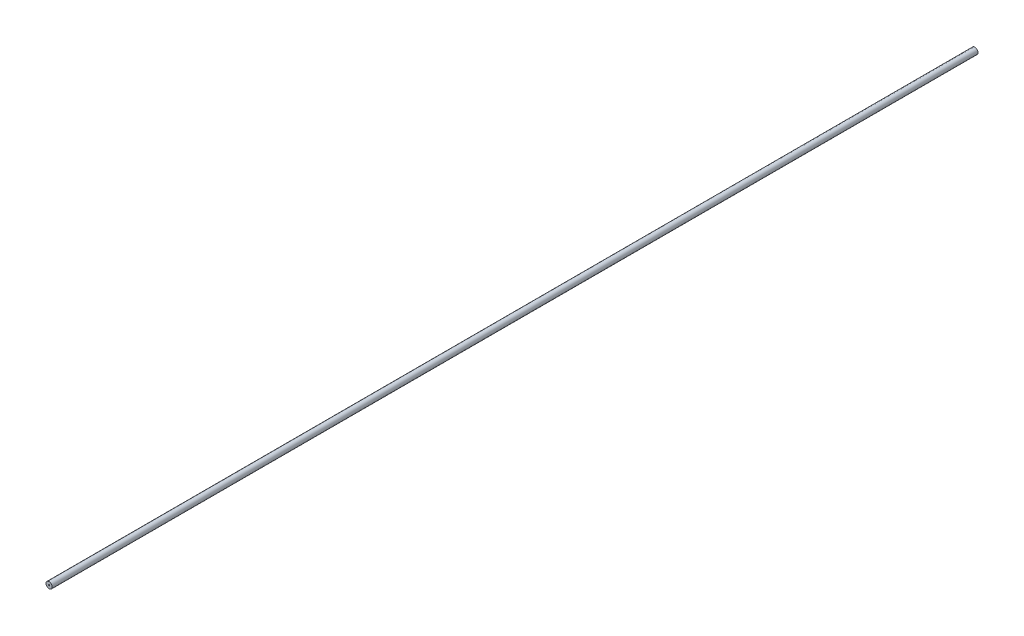
ISO-10303-21;
HEADER;
FILE_DESCRIPTION(('STEP AP214'),'2;1');
FILE_NAME('part.step','',(''),(''),'','','');
FILE_SCHEMA(('AUTOMOTIVE_DESIGN { 1 0 10303 214 1 1 1 1 }'));
ENDSEC;
DATA;
#1=APPLICATION_CONTEXT('core data for automotive mechanical design processes');
#2=APPLICATION_PROTOCOL_DEFINITION('international standard','automotive_design',2000,#1);
#3=PRODUCT_CONTEXT('',#1,'mechanical');
#4=PRODUCT('Part','Part','',(#3));
#5=PRODUCT_RELATED_PRODUCT_CATEGORY('part','',(#4));
#6=PRODUCT_DEFINITION_FORMATION('','',#4);
#7=PRODUCT_DEFINITION_CONTEXT('part definition',#1,'design');
#8=PRODUCT_DEFINITION('design','',#6,#7);
#9=PRODUCT_DEFINITION_SHAPE('','',#8);
#10=(LENGTH_UNIT() NAMED_UNIT(*) SI_UNIT(.MILLI.,.METRE.));
#11=(NAMED_UNIT(*) PLANE_ANGLE_UNIT() SI_UNIT($,.RADIAN.));
#12=(NAMED_UNIT(*) SI_UNIT($,.STERADIAN.) SOLID_ANGLE_UNIT());
#13=UNCERTAINTY_MEASURE_WITH_UNIT(LENGTH_MEASURE(1.E-05),#10,'distance_accuracy_value','');
#14=(GEOMETRIC_REPRESENTATION_CONTEXT(3) GLOBAL_UNCERTAINTY_ASSIGNED_CONTEXT((#13)) GLOBAL_UNIT_ASSIGNED_CONTEXT((#10,
#11,#12)) REPRESENTATION_CONTEXT('',''));
#15=CARTESIAN_POINT('',(0.,0.,0.));
#16=DIRECTION('',(0.,0.,1.));
#17=DIRECTION('',(1.,0.,0.));
#18=AXIS2_PLACEMENT_3D('',#15,#16,#17);
#19=CARTESIAN_POINT('',(0.,0.,-408.822965385198));
#20=DIRECTION('',(0.,0.,-1.));
#21=DIRECTION('',(1.,0.,0.));
#22=AXIS2_PLACEMENT_3D('',#19,#20,#21);
#23=PLANE('',#22);
#24=CARTESIAN_POINT('',(0.,0.,-408.822965385198));
#25=DIRECTION('',(0.,0.,1.));
#26=DIRECTION('',(1.,0.,0.));
#27=AXIS2_PLACEMENT_3D('',#24,#25,#26);
#28=CIRCLE('',#27,2.75);
#29=CARTESIAN_POINT('',(2.75,0.,-408.822965385198));
#30=VERTEX_POINT('',#29);
#31=EDGE_CURVE('E10',#30,#30,#28,.T.);
#32=ORIENTED_EDGE('',*,*,#31,.F.);
#33=EDGE_LOOP('',(#32));
#34=FACE_BOUND('',#33,.T.);
#35=CARTESIAN_POINT('',(0.,0.,-408.822965385198));
#36=DIRECTION('',(0.,0.,1.));
#37=DIRECTION('',(1.,0.,0.));
#38=AXIS2_PLACEMENT_3D('',#35,#36,#37);
#39=CIRCLE('',#38,0.5);
#40=CARTESIAN_POINT('',(0.5,0.,-408.822965385198));
#41=VERTEX_POINT('',#40);
#42=EDGE_CURVE('E46',#41,#41,#39,.T.);
#43=ORIENTED_EDGE('',*,*,#42,.T.);
#44=EDGE_LOOP('',(#43));
#45=FACE_BOUND('',#44,.T.);
#46=ADVANCED_FACE('F35',(#34,#45),#23,.T.);
#47=CARTESIAN_POINT('',(0.,0.,408.822965385198));
#48=DIRECTION('',(0.,0.,-1.));
#49=DIRECTION('',(1.,0.,0.));
#50=AXIS2_PLACEMENT_3D('',#47,#48,#49);
#51=PLANE('',#50);
#52=CARTESIAN_POINT('',(0.,0.,408.822965385198));
#53=DIRECTION('',(0.,0.,1.));
#54=DIRECTION('',(1.,0.,0.));
#55=AXIS2_PLACEMENT_3D('',#52,#53,#54);
#56=CIRCLE('',#55,2.75);
#57=CARTESIAN_POINT('',(2.75,0.,408.822965385198));
#58=VERTEX_POINT('',#57);
#59=EDGE_CURVE('E39',#58,#58,#56,.T.);
#60=ORIENTED_EDGE('',*,*,#59,.T.);
#61=EDGE_LOOP('',(#60));
#62=FACE_BOUND('',#61,.T.);
#63=CARTESIAN_POINT('',(0.,0.,408.822965385198));
#64=DIRECTION('',(0.,0.,1.));
#65=DIRECTION('',(1.,0.,0.));
#66=AXIS2_PLACEMENT_3D('',#63,#64,#65);
#67=CIRCLE('',#66,0.5);
#68=CARTESIAN_POINT('',(0.5,0.,408.822965385198));
#69=VERTEX_POINT('',#68);
#70=EDGE_CURVE('E48',#69,#69,#67,.T.);
#71=ORIENTED_EDGE('',*,*,#70,.F.);
#72=EDGE_LOOP('',(#71));
#73=FACE_BOUND('',#72,.T.);
#74=ADVANCED_FACE('F61',(#62,#73),#51,.F.);
#75=CARTESIAN_POINT('',(0.,0.,-408.822965385198));
#76=DIRECTION('',(0.,0.,1.));
#77=DIRECTION('',(-1.,0.,0.));
#78=AXIS2_PLACEMENT_3D('',#75,#76,#77);
#79=CYLINDRICAL_SURFACE('',#78,2.75);
#80=ORIENTED_EDGE('',*,*,#31,.T.);
#81=EDGE_LOOP('',(#80));
#82=FACE_BOUND('',#81,.T.);
#83=ORIENTED_EDGE('',*,*,#59,.F.);
#84=EDGE_LOOP('',(#83));
#85=FACE_BOUND('',#84,.T.);
#86=ADVANCED_FACE('F37',(#82,#85),#79,.T.);
#87=CARTESIAN_POINT('',(0.,0.,-408.822965385198));
#88=DIRECTION('',(0.,0.,1.));
#89=DIRECTION('',(-1.,0.,0.));
#90=AXIS2_PLACEMENT_3D('',#87,#88,#89);
#91=CYLINDRICAL_SURFACE('',#90,0.5);
#92=ORIENTED_EDGE('',*,*,#42,.F.);
#93=EDGE_LOOP('',(#92));
#94=FACE_BOUND('',#93,.T.);
#95=ORIENTED_EDGE('',*,*,#70,.T.);
#96=EDGE_LOOP('',(#95));
#97=FACE_BOUND('',#96,.T.);
#98=ADVANCED_FACE('F55',(#94,#97),#91,.F.);
#99=CLOSED_SHELL('',(#46,#74,#86,#98));
#100=MANIFOLD_SOLID_BREP('B2',#99);
#101=ADVANCED_BREP_SHAPE_REPRESENTATION('',(#18,#100),#14);
#102=SHAPE_DEFINITION_REPRESENTATION(#9,#101);
ENDSEC;
END-ISO-10303-21;
